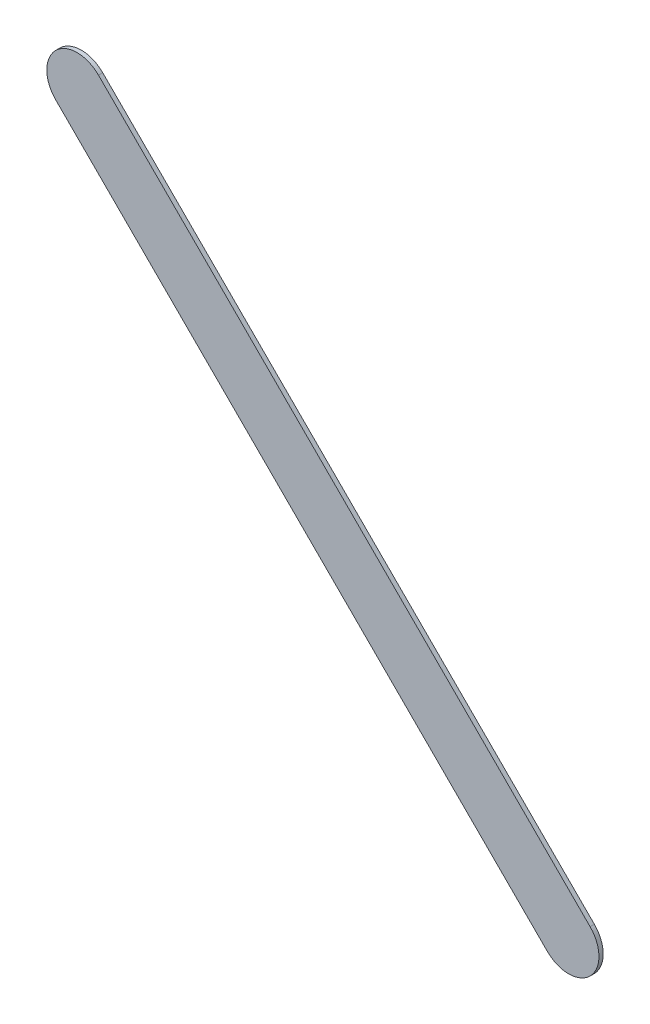
ISO-10303-21;
HEADER;
FILE_DESCRIPTION(('STEP AP214'),'2;1');
FILE_NAME('part.step','',(''),(''),'','','');
FILE_SCHEMA(('AUTOMOTIVE_DESIGN { 1 0 10303 214 1 1 1 1 }'));
ENDSEC;
DATA;
#1=APPLICATION_CONTEXT('core data for automotive mechanical design processes');
#2=APPLICATION_PROTOCOL_DEFINITION('international standard','automotive_design',2000,#1);
#3=PRODUCT_CONTEXT('',#1,'mechanical');
#4=PRODUCT('Part','Part','',(#3));
#5=PRODUCT_RELATED_PRODUCT_CATEGORY('part','',(#4));
#6=PRODUCT_DEFINITION_FORMATION('','',#4);
#7=PRODUCT_DEFINITION_CONTEXT('part definition',#1,'design');
#8=PRODUCT_DEFINITION('design','',#6,#7);
#9=PRODUCT_DEFINITION_SHAPE('','',#8);
#10=(LENGTH_UNIT() NAMED_UNIT(*) SI_UNIT(.MILLI.,.METRE.));
#11=(NAMED_UNIT(*) PLANE_ANGLE_UNIT() SI_UNIT($,.RADIAN.));
#12=(NAMED_UNIT(*) SI_UNIT($,.STERADIAN.) SOLID_ANGLE_UNIT());
#13=UNCERTAINTY_MEASURE_WITH_UNIT(LENGTH_MEASURE(1.E-05),#10,'distance_accuracy_value','');
#14=(GEOMETRIC_REPRESENTATION_CONTEXT(3) GLOBAL_UNCERTAINTY_ASSIGNED_CONTEXT((#13)) GLOBAL_UNIT_ASSIGNED_CONTEXT((#10,
#11,#12)) REPRESENTATION_CONTEXT('',''));
#15=CARTESIAN_POINT('',(0.,0.,0.));
#16=DIRECTION('',(0.,0.,1.));
#17=DIRECTION('',(1.,0.,0.));
#18=AXIS2_PLACEMENT_3D('',#15,#16,#17);
#19=CARTESIAN_POINT('',(119.203223,-95.807776,0.));
#20=DIRECTION('',(0.,0.,1.));
#21=DIRECTION('',(1.,0.,0.));
#22=AXIS2_PLACEMENT_3D('',#19,#20,#21);
#23=PLANE('',#22);
#24=DIRECTION('',(0.707106781186548,-0.707106781186548,0.));
#25=VECTOR('',#24,1.);
#26=CARTESIAN_POINT('',(119.203223,-95.807776,0.));
#27=LINE('',#26,#25);
#28=CARTESIAN_POINT('',(119.203223,-95.807776,0.));
#29=VERTEX_POINT('',#28);
#30=CARTESIAN_POINT('',(123.267223,-99.871776,0.));
#31=VERTEX_POINT('',#30);
#32=EDGE_CURVE('E93',#29,#31,#27,.T.);
#33=ORIENTED_EDGE('',*,*,#32,.T.);
#34=CARTESIAN_POINT('',(123.4439995,-99.6949995,0.));
#35=DIRECTION('',(0.,0.,1.));
#36=DIRECTION('',(-0.707106781186548,-0.707106781186548,0.));
#37=AXIS2_PLACEMENT_3D('',#34,#35,#36);
#38=CIRCLE('',#37,0.249999723809);
#39=CARTESIAN_POINT('',(123.620776,-99.518223,0.));
#40=VERTEX_POINT('',#39);
#41=EDGE_CURVE('E73',#31,#40,#38,.T.);
#42=ORIENTED_EDGE('',*,*,#41,.T.);
#43=DIRECTION('',(-0.707106781186548,0.707106781186548,0.));
#44=VECTOR('',#43,1.);
#45=CARTESIAN_POINT('',(123.620776,-99.518223,0.));
#46=LINE('',#45,#44);
#47=CARTESIAN_POINT('',(119.556776,-95.454223,0.));
#48=VERTEX_POINT('',#47);
#49=EDGE_CURVE('E87',#40,#48,#46,.T.);
#50=ORIENTED_EDGE('',*,*,#49,.T.);
#51=CARTESIAN_POINT('',(119.3799995,-95.6309995,0.));
#52=DIRECTION('',(0.,0.,1.));
#53=DIRECTION('',(0.707106781186548,0.707106781186548,0.));
#54=AXIS2_PLACEMENT_3D('',#51,#52,#53);
#55=CIRCLE('',#54,0.249999723809);
#56=EDGE_CURVE('E11',#48,#29,#55,.T.);
#57=ORIENTED_EDGE('',*,*,#56,.T.);
#58=EDGE_LOOP('',(#33,#42,#50,#57));
#59=FACE_BOUND('',#58,.T.);
#60=ADVANCED_FACE('F17',(#59),#23,.T.);
#61=CARTESIAN_POINT('',(119.203223,-95.807776,-0.035));
#62=DIRECTION('',(0.,0.,1.));
#63=DIRECTION('',(1.,0.,0.));
#64=AXIS2_PLACEMENT_3D('',#61,#62,#63);
#65=PLANE('',#64);
#66=CARTESIAN_POINT('',(119.3799995,-95.6309995,-0.035));
#67=DIRECTION('',(0.,0.,1.));
#68=DIRECTION('',(0.707106781186548,0.707106781186548,0.));
#69=AXIS2_PLACEMENT_3D('',#66,#67,#68);
#70=CIRCLE('',#69,0.249999723809);
#71=CARTESIAN_POINT('',(119.556776,-95.454223,-0.035));
#72=VERTEX_POINT('',#71);
#73=CARTESIAN_POINT('',(119.203223,-95.807776,-0.035));
#74=VERTEX_POINT('',#73);
#75=EDGE_CURVE('E20',#72,#74,#70,.T.);
#76=ORIENTED_EDGE('',*,*,#75,.F.);
#77=DIRECTION('',(-0.707106781186548,0.707106781186548,0.));
#78=VECTOR('',#77,1.);
#79=CARTESIAN_POINT('',(123.620776,-99.518223,-0.035));
#80=LINE('',#79,#78);
#81=CARTESIAN_POINT('',(123.620776,-99.518223,-0.035));
#82=VERTEX_POINT('',#81);
#83=EDGE_CURVE('E57',#82,#72,#80,.T.);
#84=ORIENTED_EDGE('',*,*,#83,.F.);
#85=CARTESIAN_POINT('',(123.4439995,-99.6949995,-0.035));
#86=DIRECTION('',(0.,0.,1.));
#87=DIRECTION('',(-0.707106781186548,-0.707106781186548,0.));
#88=AXIS2_PLACEMENT_3D('',#85,#86,#87);
#89=CIRCLE('',#88,0.249999723809);
#90=CARTESIAN_POINT('',(123.267223,-99.871776,-0.035));
#91=VERTEX_POINT('',#90);
#92=EDGE_CURVE('E95',#91,#82,#89,.T.);
#93=ORIENTED_EDGE('',*,*,#92,.F.);
#94=DIRECTION('',(0.707106781186548,-0.707106781186548,0.));
#95=VECTOR('',#94,1.);
#96=CARTESIAN_POINT('',(119.203223,-95.807776,-0.035));
#97=LINE('',#96,#95);
#98=EDGE_CURVE('E92',#74,#91,#97,.T.);
#99=ORIENTED_EDGE('',*,*,#98,.F.);
#100=EDGE_LOOP('',(#76,#84,#93,#99));
#101=FACE_BOUND('',#100,.T.);
#102=ADVANCED_FACE('F97',(#101),#65,.F.);
#103=CARTESIAN_POINT('',(119.3799995,-95.6309995,-0.035));
#104=DIRECTION('',(0.,0.,-1.));
#105=DIRECTION('',(0.707106781186548,0.707106781186548,0.));
#106=AXIS2_PLACEMENT_3D('',#103,#104,#105);
#107=CYLINDRICAL_SURFACE('',#106,0.249999723809);
#108=ORIENTED_EDGE('',*,*,#75,.T.);
#109=DIRECTION('',(0.,0.,1.));
#110=VECTOR('',#109,1.);
#111=CARTESIAN_POINT('',(119.203223,-95.807776,-0.035));
#112=LINE('',#111,#110);
#113=EDGE_CURVE('E82',#74,#29,#112,.T.);
#114=ORIENTED_EDGE('',*,*,#113,.T.);
#115=ORIENTED_EDGE('',*,*,#56,.F.);
#116=DIRECTION('',(0.,0.,1.));
#117=VECTOR('',#116,1.);
#118=CARTESIAN_POINT('',(119.556776,-95.454223,-0.035));
#119=LINE('',#118,#117);
#120=EDGE_CURVE('E85',#72,#48,#119,.T.);
#121=ORIENTED_EDGE('',*,*,#120,.F.);
#122=EDGE_LOOP('',(#108,#114,#115,#121));
#123=FACE_BOUND('',#122,.T.);
#124=ADVANCED_FACE('F81',(#123),#107,.T.);
#125=CARTESIAN_POINT('',(123.620776,-99.518223,-0.035));
#126=DIRECTION('',(-0.707106781186548,-0.707106781186548,0.));
#127=DIRECTION('',(-0.707106781186548,0.707106781186548,0.));
#128=AXIS2_PLACEMENT_3D('',#125,#126,#127);
#129=PLANE('',#128);
#130=ORIENTED_EDGE('',*,*,#83,.T.);
#131=ORIENTED_EDGE('',*,*,#120,.T.);
#132=ORIENTED_EDGE('',*,*,#49,.F.);
#133=DIRECTION('',(0.,0.,1.));
#134=VECTOR('',#133,1.);
#135=CARTESIAN_POINT('',(123.620776,-99.518223,-0.035));
#136=LINE('',#135,#134);
#137=EDGE_CURVE('E109',#82,#40,#136,.T.);
#138=ORIENTED_EDGE('',*,*,#137,.F.);
#139=EDGE_LOOP('',(#130,#131,#132,#138));
#140=FACE_BOUND('',#139,.T.);
#141=ADVANCED_FACE('F123',(#140),#129,.F.);
#142=CARTESIAN_POINT('',(123.4439995,-99.6949995,-0.035));
#143=DIRECTION('',(0.,0.,-1.));
#144=DIRECTION('',(-0.707106781186548,-0.707106781186548,0.));
#145=AXIS2_PLACEMENT_3D('',#142,#143,#144);
#146=CYLINDRICAL_SURFACE('',#145,0.249999723809);
#147=ORIENTED_EDGE('',*,*,#92,.T.);
#148=ORIENTED_EDGE('',*,*,#137,.T.);
#149=ORIENTED_EDGE('',*,*,#41,.F.);
#150=DIRECTION('',(0.,0.,1.));
#151=VECTOR('',#150,1.);
#152=CARTESIAN_POINT('',(123.267223,-99.871776,-0.035));
#153=LINE('',#152,#151);
#154=EDGE_CURVE('E100',#91,#31,#153,.T.);
#155=ORIENTED_EDGE('',*,*,#154,.F.);
#156=EDGE_LOOP('',(#147,#148,#149,#155));
#157=FACE_BOUND('',#156,.T.);
#158=ADVANCED_FACE('F125',(#157),#146,.T.);
#159=CARTESIAN_POINT('',(119.203223,-95.807776,-0.035));
#160=DIRECTION('',(0.707106781186548,0.707106781186548,0.));
#161=DIRECTION('',(0.,0.,-1.));
#162=AXIS2_PLACEMENT_3D('',#159,#160,#161);
#163=PLANE('',#162);
#164=ORIENTED_EDGE('',*,*,#98,.T.);
#165=ORIENTED_EDGE('',*,*,#154,.T.);
#166=ORIENTED_EDGE('',*,*,#32,.F.);
#167=ORIENTED_EDGE('',*,*,#113,.F.);
#168=EDGE_LOOP('',(#164,#165,#166,#167));
#169=FACE_BOUND('',#168,.T.);
#170=ADVANCED_FACE('F90',(#169),#163,.F.);
#171=CLOSED_SHELL('',(#60,#102,#124,#141,#158,#170));
#172=MANIFOLD_SOLID_BREP('B1',#171);
#173=ADVANCED_BREP_SHAPE_REPRESENTATION('',(#18,#172),#14);
#174=SHAPE_DEFINITION_REPRESENTATION(#9,#173);
ENDSEC;
END-ISO-10303-21;
